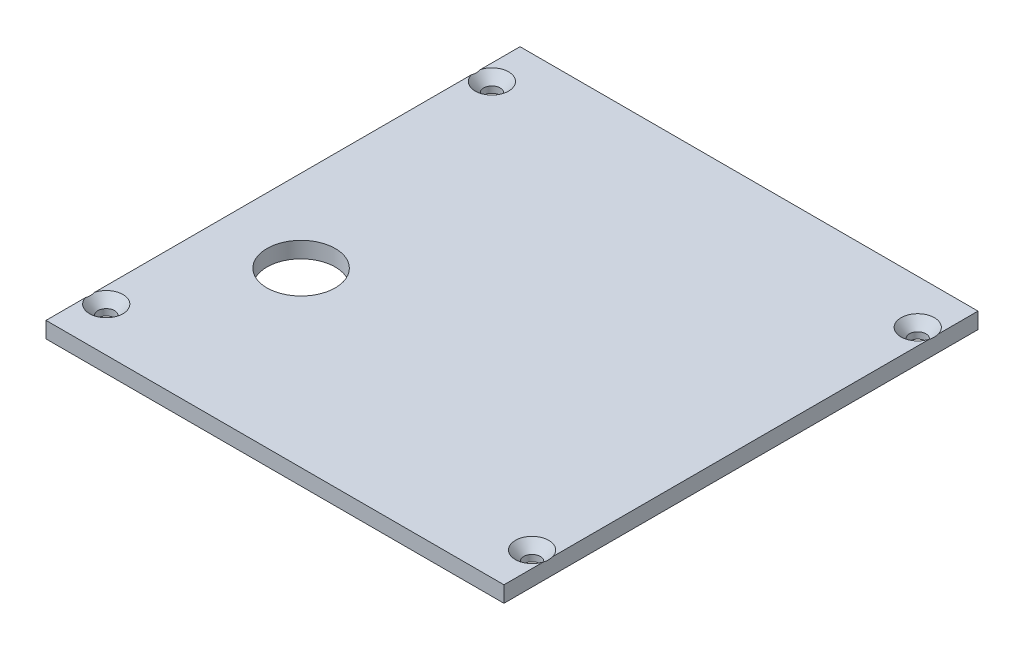
ISO-10303-21;
HEADER;
FILE_DESCRIPTION(('STEP AP214'),'2;1');
FILE_NAME('part.step','',(''),(''),'','','');
FILE_SCHEMA(('AUTOMOTIVE_DESIGN { 1 0 10303 214 1 1 1 1 }'));
ENDSEC;
DATA;
#1=APPLICATION_CONTEXT('core data for automotive mechanical design processes');
#2=APPLICATION_PROTOCOL_DEFINITION('international standard','automotive_design',2000,#1);
#3=PRODUCT_CONTEXT('',#1,'mechanical');
#4=PRODUCT('Part','Part','',(#3));
#5=PRODUCT_RELATED_PRODUCT_CATEGORY('part','',(#4));
#6=PRODUCT_DEFINITION_FORMATION('','',#4);
#7=PRODUCT_DEFINITION_CONTEXT('part definition',#1,'design');
#8=PRODUCT_DEFINITION('design','',#6,#7);
#9=PRODUCT_DEFINITION_SHAPE('','',#8);
#10=(LENGTH_UNIT() NAMED_UNIT(*) SI_UNIT(.MILLI.,.METRE.));
#11=(NAMED_UNIT(*) PLANE_ANGLE_UNIT() SI_UNIT($,.RADIAN.));
#12=(NAMED_UNIT(*) SI_UNIT($,.STERADIAN.) SOLID_ANGLE_UNIT());
#13=UNCERTAINTY_MEASURE_WITH_UNIT(LENGTH_MEASURE(1.E-05),#10,'distance_accuracy_value','');
#14=(GEOMETRIC_REPRESENTATION_CONTEXT(3) GLOBAL_UNCERTAINTY_ASSIGNED_CONTEXT((#13)) GLOBAL_UNIT_ASSIGNED_CONTEXT((#10,
#11,#12)) REPRESENTATION_CONTEXT('',''));
#15=CARTESIAN_POINT('',(0.,0.,0.));
#16=DIRECTION('',(0.,0.,1.));
#17=DIRECTION('',(1.,0.,0.));
#18=AXIS2_PLACEMENT_3D('',#15,#16,#17);
#19=CARTESIAN_POINT('',(0.,3.175,0.));
#20=DIRECTION('',(0.,-1.,0.));
#21=DIRECTION('',(0.,0.,-1.));
#22=AXIS2_PLACEMENT_3D('',#19,#20,#21);
#23=PLANE('',#22);
#24=CARTESIAN_POINT('',(-28.971875,3.175,12.7));
#25=DIRECTION('',(0.,1.,0.));
#26=DIRECTION('',(0.,0.,1.));
#27=AXIS2_PLACEMENT_3D('',#24,#25,#26);
#28=CIRCLE('',#27,6.746875);
#29=CARTESIAN_POINT('',(-28.971875,3.175,19.446875));
#30=VERTEX_POINT('',#29);
#31=EDGE_CURVE('E240',#30,#30,#28,.T.);
#32=ORIENTED_EDGE('',*,*,#31,.F.);
#33=EDGE_LOOP('',(#32));
#34=FACE_BOUND('',#33,.T.);
#35=CARTESIAN_POINT('',(42.06875,3.175,38.1));
#36=DIRECTION('',(0.,1.,0.));
#37=DIRECTION('',(0.,0.,1.));
#38=AXIS2_PLACEMENT_3D('',#35,#36,#37);
#39=CIRCLE('',#38,3.2990917);
#40=CARTESIAN_POINT('',(45.24375,3.175,37.2036847401672));
#41=VERTEX_POINT('',#40);
#42=CARTESIAN_POINT('',(45.24375,3.175,38.9963152598327));
#43=VERTEX_POINT('',#42);
#44=EDGE_CURVE('E52',#41,#43,#39,.T.);
#45=ORIENTED_EDGE('',*,*,#44,.F.);
#46=DIRECTION('',(0.,0.,-1.));
#47=VECTOR('',#46,1.);
#48=CARTESIAN_POINT('',(45.24375,3.175,-46.83125));
#49=LINE('',#48,#47);
#50=CARTESIAN_POINT('',(45.24375,3.175,-37.2036847401672));
#51=VERTEX_POINT('',#50);
#52=EDGE_CURVE('E106',#41,#51,#49,.T.);
#53=ORIENTED_EDGE('',*,*,#52,.T.);
#54=CARTESIAN_POINT('',(42.06875,3.175,-38.1));
#55=DIRECTION('',(0.,1.,0.));
#56=DIRECTION('',(0.,0.,1.));
#57=AXIS2_PLACEMENT_3D('',#54,#55,#56);
#58=CIRCLE('',#57,3.2990917);
#59=CARTESIAN_POINT('',(45.24375,3.175,-38.9963152598328));
#60=VERTEX_POINT('',#59);
#61=EDGE_CURVE('E207',#60,#51,#58,.T.);
#62=ORIENTED_EDGE('',*,*,#61,.F.);
#63=CARTESIAN_POINT('',(45.24375,3.175,-46.83125));
#64=VERTEX_POINT('',#63);
#65=EDGE_CURVE('E116',#60,#64,#49,.T.);
#66=ORIENTED_EDGE('',*,*,#65,.T.);
#67=DIRECTION('',(-1.,0.,0.));
#68=VECTOR('',#67,1.);
#69=CARTESIAN_POINT('',(45.24375,3.175,-46.83125));
#70=LINE('',#69,#68);
#71=CARTESIAN_POINT('',(-45.24375,3.175,-46.83125));
#72=VERTEX_POINT('',#71);
#73=EDGE_CURVE('E118',#64,#72,#70,.T.);
#74=ORIENTED_EDGE('',*,*,#73,.T.);
#75=DIRECTION('',(0.,0.,1.));
#76=VECTOR('',#75,1.);
#77=CARTESIAN_POINT('',(-45.24375,3.175,-46.83125));
#78=LINE('',#77,#76);
#79=CARTESIAN_POINT('',(-45.24375,3.175,-38.9963152598326));
#80=VERTEX_POINT('',#79);
#81=EDGE_CURVE('E198',#72,#80,#78,.T.);
#82=ORIENTED_EDGE('',*,*,#81,.T.);
#83=CARTESIAN_POINT('',(-42.06875,3.175,-38.1));
#84=DIRECTION('',(0.,1.,0.));
#85=DIRECTION('',(0.,0.,1.));
#86=AXIS2_PLACEMENT_3D('',#83,#84,#85);
#87=CIRCLE('',#86,3.2990917);
#88=CARTESIAN_POINT('',(-45.24375,3.175,-37.2036847401674));
#89=VERTEX_POINT('',#88);
#90=EDGE_CURVE('E58',#89,#80,#87,.T.);
#91=ORIENTED_EDGE('',*,*,#90,.F.);
#92=CARTESIAN_POINT('',(-45.24375,3.175,37.2036847401673));
#93=VERTEX_POINT('',#92);
#94=EDGE_CURVE('E205',#89,#93,#78,.T.);
#95=ORIENTED_EDGE('',*,*,#94,.T.);
#96=CARTESIAN_POINT('',(-42.06875,3.175,38.1));
#97=DIRECTION('',(0.,1.,0.));
#98=DIRECTION('',(0.,0.,1.));
#99=AXIS2_PLACEMENT_3D('',#96,#97,#98);
#100=CIRCLE('',#99,3.2990917);
#101=CARTESIAN_POINT('',(-45.24375,3.175,38.9963152598327));
#102=VERTEX_POINT('',#101);
#103=EDGE_CURVE('E225',#102,#93,#100,.T.);
#104=ORIENTED_EDGE('',*,*,#103,.F.);
#105=CARTESIAN_POINT('',(-45.24375,3.175,46.83125));
#106=VERTEX_POINT('',#105);
#107=EDGE_CURVE('E135',#102,#106,#78,.T.);
#108=ORIENTED_EDGE('',*,*,#107,.T.);
#109=DIRECTION('',(1.,0.,0.));
#110=VECTOR('',#109,1.);
#111=CARTESIAN_POINT('',(45.24375,3.175,46.83125));
#112=LINE('',#111,#110);
#113=CARTESIAN_POINT('',(45.24375,3.175,46.83125));
#114=VERTEX_POINT('',#113);
#115=EDGE_CURVE('E119',#106,#114,#112,.T.);
#116=ORIENTED_EDGE('',*,*,#115,.T.);
#117=EDGE_CURVE('E108',#114,#43,#49,.T.);
#118=ORIENTED_EDGE('',*,*,#117,.T.);
#119=EDGE_LOOP('',(#45,#53,#62,#66,#74,#82,#91,#95,#104,#108,#116,#118));
#120=FACE_BOUND('',#119,.T.);
#121=ADVANCED_FACE('F32',(#34,#120),#23,.F.);
#122=CARTESIAN_POINT('',(-45.24375,3.175,-46.83125));
#123=DIRECTION('',(1.,0.,0.));
#124=DIRECTION('',(0.,0.,-1.));
#125=AXIS2_PLACEMENT_3D('',#122,#123,#124);
#126=PLANE('',#125);
#127=ORIENTED_EDGE('',*,*,#94,.F.);
#128=CARTESIAN_POINT('',(-45.24375,6.989710070673,-43.9034326264607));
#129=CARTESIAN_POINT('',(-45.24375,6.87305813893157,-43.7878326298759));
#130=CARTESIAN_POINT('',(-45.24375,6.75679059182277,-43.6718418920867));
#131=CARTESIAN_POINT('',(-45.24375,6.5251952224115,-43.4389124786819));
#132=CARTESIAN_POINT('',(-45.24375,6.40986745755019,-43.3219737459819));
#133=CARTESIAN_POINT('',(-45.24375,6.18008387319701,-43.0867369402372));
#134=CARTESIAN_POINT('',(-45.24375,6.06563053557004,-42.9684364393237));
#135=CARTESIAN_POINT('',(-45.24375,5.83809959865298,-42.7305229725693));
#136=CARTESIAN_POINT('',(-45.24375,5.72502196963105,-42.6109100351995));
#137=CARTESIAN_POINT('',(-45.24375,5.49499972692886,-42.3641507826136));
#138=CARTESIAN_POINT('',(-45.24375,5.37814063659988,-42.2369245707484));
#139=CARTESIAN_POINT('',(-45.24375,5.14677123102929,-41.9803554876681));
#140=CARTESIAN_POINT('',(-45.24375,5.03226084221294,-41.8510126829857));
#141=CARTESIAN_POINT('',(-45.24375,4.80636213339492,-41.5898265297254));
#142=CARTESIAN_POINT('',(-45.24375,4.69497104962606,-41.4579855802024));
#143=CARTESIAN_POINT('',(-45.24375,4.47616547764946,-41.1910558796966));
#144=CARTESIAN_POINT('',(-45.24375,4.36875045307876,-41.0559675708617));
#145=CARTESIAN_POINT('',(-45.24375,4.16229712923296,-40.7856552414501));
#146=CARTESIAN_POINT('',(-45.24375,4.063106326339,-40.6505484495983));
#147=CARTESIAN_POINT('',(-45.24375,3.87156533114407,-40.3753782962137));
#148=CARTESIAN_POINT('',(-45.24375,3.77921978118362,-40.2353116644282));
#149=CARTESIAN_POINT('',(-45.24375,3.60532501089976,-39.9509146153839));
#150=CARTESIAN_POINT('',(-45.24375,3.52365752455923,-39.8066573297938));
#151=CARTESIAN_POINT('',(-45.24375,3.37393312067745,-39.5113162027645));
#152=CARTESIAN_POINT('',(-45.24375,3.30585320124994,-39.36024443823));
#153=CARTESIAN_POINT('',(-45.24375,3.22240302633766,-39.1396332332299));
#154=CARTESIAN_POINT('',(-45.24375,3.19919988534441,-39.0730389983241));
#155=CARTESIAN_POINT('',(-45.24375,3.15671831904853,-38.9384357966277));
#156=CARTESIAN_POINT('',(-45.24375,3.13744876910674,-38.8704240039713));
#157=CARTESIAN_POINT('',(-45.24375,3.1003077460929,-38.720833287961));
#158=CARTESIAN_POINT('',(-45.24375,3.08332335400403,-38.6390304687463));
#159=CARTESIAN_POINT('',(-45.24375,3.05633904271579,-38.474251309591));
#160=CARTESIAN_POINT('',(-45.24375,3.04634045929933,-38.3912747483078));
#161=CARTESIAN_POINT('',(-45.24375,3.03382521861158,-38.2248497036844));
#162=CARTESIAN_POINT('',(-45.24375,3.03129972265945,-38.1414018948921));
#163=CARTESIAN_POINT('',(-45.24375,3.03383658485633,-37.9746280645344));
#164=CARTESIAN_POINT('',(-45.24375,3.03889846478648,-37.8913020356247));
#165=CARTESIAN_POINT('',(-45.24375,3.05604892542834,-37.7282914966357));
#166=CARTESIAN_POINT('',(-45.24375,3.06788943816949,-37.6485804251183));
#167=CARTESIAN_POINT('',(-45.24375,3.09788708037763,-37.4903522736671));
#168=CARTESIAN_POINT('',(-45.24375,3.11604554095329,-37.4118354489868));
#169=CARTESIAN_POINT('',(-45.24375,3.15802658216042,-37.2562116975725));
#170=CARTESIAN_POINT('',(-45.24375,3.1818582027336,-37.1791072347425));
#171=CARTESIAN_POINT('',(-45.24375,3.2344233667454,-37.0266038839596));
#172=CARTESIAN_POINT('',(-45.24375,3.26315696966239,-36.951205016714));
#173=CARTESIAN_POINT('',(-45.24375,3.33338061296683,-36.7814142257047));
#174=CARTESIAN_POINT('',(-45.24375,3.37619587453448,-36.6875723520631));
#175=CARTESIAN_POINT('',(-45.24375,3.46733489242363,-36.5025964034572));
#176=CARTESIAN_POINT('',(-45.24375,3.51566050806365,-36.4114632556325));
#177=CARTESIAN_POINT('',(-45.24375,3.61681385113858,-36.2315315316244));
#178=CARTESIAN_POINT('',(-45.24375,3.66964951937834,-36.1427374489912));
#179=CARTESIAN_POINT('',(-45.24375,3.77887111919667,-35.9673954005948));
#180=CARTESIAN_POINT('',(-45.24375,3.83525642595159,-35.8808470432952));
#181=CARTESIAN_POINT('',(-45.24375,3.951789697403,-35.7084037838518));
#182=CARTESIAN_POINT('',(-45.24375,4.01198187504771,-35.6225388871093));
#183=CARTESIAN_POINT('',(-45.24375,4.13478793957747,-35.4525616558967));
#184=CARTESIAN_POINT('',(-45.24375,4.1974018937254,-35.368449370204));
#185=CARTESIAN_POINT('',(-45.24375,4.32455372262778,-35.2018352843151));
#186=CARTESIAN_POINT('',(-45.24375,4.38908951289633,-35.1193318890963));
#187=CARTESIAN_POINT('',(-45.24375,4.51981187211302,-34.9556527007914));
#188=CARTESIAN_POINT('',(-45.24375,4.58599837348585,-34.8744768535837));
#189=CARTESIAN_POINT('',(-45.24375,4.80862518728445,-34.6061434736446));
#190=CARTESIAN_POINT('',(-45.24375,4.9681115981241,-34.4215122675117));
#191=CARTESIAN_POINT('',(-45.24375,5.2921977748846,-34.0567795972118));
#192=CARTESIAN_POINT('',(-45.24375,5.45679845873086,-33.8766789568249));
#193=CARTESIAN_POINT('',(-45.24375,5.78975187696567,-33.5198110738286));
#194=CARTESIAN_POINT('',(-45.24375,5.95810654527786,-33.3430456402109));
#195=CARTESIAN_POINT('',(-45.24375,6.29753521271734,-32.9921433817898));
#196=CARTESIAN_POINT('',(-45.24375,6.468609295641,-32.8180066383108));
#197=CARTESIAN_POINT('',(-45.24375,6.81325931704773,-32.4713568700036));
#198=CARTESIAN_POINT('',(-45.24375,6.98684047303314,-32.2988490415872));
#199=CARTESIAN_POINT('',(-45.24375,7.33562797786353,-31.9554816145835));
#200=CARTESIAN_POINT('',(-45.24375,7.5108343516648,-31.7846220413886));
#201=CARTESIAN_POINT('',(-45.24375,8.0382509971399,-31.2741375068304));
#202=CARTESIAN_POINT('',(-45.24375,8.39237512276739,-30.9364907041535));
#203=CARTESIAN_POINT('',(-45.24375,9.06030852273246,-30.3059938274068));
#204=CARTESIAN_POINT('',(-45.24375,9.37373097008681,-30.0127322139278));
#205=CARTESIAN_POINT('',(-45.24375,10.0025060482199,-29.428225646975));
#206=CARTESIAN_POINT('',(-45.24375,10.3178588611297,-29.1369808894949));
#207=CARTESIAN_POINT('',(-45.24375,10.9485176914573,-28.5573828121677));
#208=CARTESIAN_POINT('',(-45.24375,11.2638171513183,-28.2690223474066));
#209=CARTESIAN_POINT('',(-45.24375,11.8954830947937,-27.6935445814536));
#210=CARTESIAN_POINT('',(-45.24375,12.2118494525817,-27.4064271421975));
#211=CARTESIAN_POINT('',(-45.24375,12.5286162920423,-27.1197545351163));
#212=B_SPLINE_CURVE_WITH_KNOTS('',3,(#128,#129,#130,#131,#132,#133,#134,#135,#136,#137,#138,
#139,#140,#141,#142,#143,#144,#145,#146,#147,#148,#149,#150,#151,#152,#153,#154,#155,#156,#157,
#158,#159,#160,#161,#162,#163,#164,#165,#166,#167,#168,#169,#170,#171,#172,#173,#174,#175,#176,
#177,#178,#179,#180,#181,#182,#183,#184,#185,#186,#187,#188,#189,#190,#191,#192,#193,#194,#195,
#196,#197,#198,#199,#200,#201,#202,#203,#204,#205,#206,#207,#208,#209,#210,#211),.UNSPECIFIED.,
.F.,.F.,(4,2,2,2,2,2,2,2,2,2,2,2,2,2,2,2,2,2,2,2,2,2,2,2,2,2,2,2,2,2,2,2,2,2,2,2,2,2,2,2,2,4),
(0.,0.492687873977187,0.985405639374898,1.47920931164693,1.9730022927932,2.49122930634338,
3.00944006119379,3.52717612915784,4.04484209905923,4.54751630419466,5.05052835376831,
5.54738625055593,6.04339576449105,6.25485653533402,6.46678927619565,6.71715112238516,
6.96756082811849,7.21767424695734,7.46777190225355,7.70925400946692,7.95078702462907,
8.1927075195642,8.43463095005899,8.74384066836764,9.05315503153315,9.3630257016498,
9.6728419786031,9.98737469808601,10.3019161597442,10.6161280664448,10.9303271312707,
11.662096401547,12.3939977794678,13.1262853413443,13.8585955119294,14.5927507536451,
15.3269172875283,16.7947575115168,18.0824301844585,19.3702262824726,20.652053598462,
21.9337346871531),.UNSPECIFIED.);
#213=EDGE_CURVE('E46',#89,#80,#212,.F.);
#214=ORIENTED_EDGE('',*,*,#213,.T.);
#215=ORIENTED_EDGE('',*,*,#81,.F.);
#216=DIRECTION('',(0.,-1.,0.));
#217=VECTOR('',#216,1.);
#218=CARTESIAN_POINT('',(-45.24375,3.175,-46.83125));
#219=LINE('',#218,#217);
#220=CARTESIAN_POINT('',(-45.24375,0.,-46.83125));
#221=VERTEX_POINT('',#220);
#222=EDGE_CURVE('E124',#72,#221,#219,.T.);
#223=ORIENTED_EDGE('',*,*,#222,.T.);
#224=DIRECTION('',(0.,0.,1.));
#225=VECTOR('',#224,1.);
#226=CARTESIAN_POINT('',(-45.24375,0.,-46.83125));
#227=LINE('',#226,#225);
#228=CARTESIAN_POINT('',(-45.24375,0.,46.83125));
#229=VERTEX_POINT('',#228);
#230=EDGE_CURVE('E125',#221,#229,#227,.T.);
#231=ORIENTED_EDGE('',*,*,#230,.T.);
#232=DIRECTION('',(0.,-1.,0.));
#233=VECTOR('',#232,1.);
#234=CARTESIAN_POINT('',(-45.24375,3.175,46.83125));
#235=LINE('',#234,#233);
#236=EDGE_CURVE('E144',#106,#229,#235,.T.);
#237=ORIENTED_EDGE('',*,*,#236,.F.);
#238=ORIENTED_EDGE('',*,*,#107,.F.);
#239=CARTESIAN_POINT('',(-45.24375,6.98971006939015,32.2965673748104));
#240=CARTESIAN_POINT('',(-45.24375,6.87305813769032,32.4121673713599));
#241=CARTESIAN_POINT('',(-45.24375,6.75679059062309,32.5281581091137));
#242=CARTESIAN_POINT('',(-45.24375,6.5251952212949,32.7610875224474));
#243=CARTESIAN_POINT('',(-45.24375,6.40986745647509,32.8780262551119));
#244=CARTESIAN_POINT('',(-45.24375,6.18008387220493,33.1132630607852));
#245=CARTESIAN_POINT('',(-45.24375,6.06563053461948,33.2315635616629));
#246=CARTESIAN_POINT('',(-45.24375,5.8380995977853,33.4694770283453));
#247=CARTESIAN_POINT('',(-45.24375,5.7250219688047,33.589089965679));
#248=CARTESIAN_POINT('',(-45.24375,5.49499972618867,33.8358492181888));
#249=CARTESIAN_POINT('',(-45.24375,5.37814063590446,33.9630754300139));
#250=CARTESIAN_POINT('',(-45.24375,5.14677123042286,34.2196445130133));
#251=CARTESIAN_POINT('',(-45.24375,5.03226084165072,34.3489873176549));
#252=CARTESIAN_POINT('',(-45.24375,4.80636213292021,34.6101734708329));
#253=CARTESIAN_POINT('',(-45.24375,4.69497104919465,34.7420144203142));
#254=CARTESIAN_POINT('',(-45.24375,4.47616547730326,35.0089441207354));
#255=CARTESIAN_POINT('',(-45.24375,4.36875045277447,35.1440324295273));
#256=CARTESIAN_POINT('',(-45.24375,4.16229712899054,35.4143447588764));
#257=CARTESIAN_POINT('',(-45.24375,4.06310632611753,35.5494515507094));
#258=CARTESIAN_POINT('',(-45.24375,3.87156533096386,35.8246217040556));
#259=CARTESIAN_POINT('',(-45.24375,3.77921978102372,35.9646883358215));
#260=CARTESIAN_POINT('',(-45.24375,3.60532501077874,36.2490853848257));
#261=CARTESIAN_POINT('',(-45.24375,3.52365752445681,36.3933426703954));
#262=CARTESIAN_POINT('',(-45.24375,3.37393312060966,36.688683797382));
#263=CARTESIAN_POINT('',(-45.24375,3.30585320119819,36.8397555618942));
#264=CARTESIAN_POINT('',(-45.24375,3.22240302630457,37.0603667668629));
#265=CARTESIAN_POINT('',(-45.24375,3.19919988531602,37.1269610017606));
#266=CARTESIAN_POINT('',(-45.24375,3.1567183190287,37.2615642034404));
#267=CARTESIAN_POINT('',(-45.24375,3.13744876909077,37.3295759960883));
#268=CARTESIAN_POINT('',(-45.24375,3.10030774608519,37.4791667120755));
#269=CARTESIAN_POINT('',(-45.24375,3.0833233540002,37.5609695312757));
#270=CARTESIAN_POINT('',(-45.24375,3.05633904271722,37.7257486904015));
#271=CARTESIAN_POINT('',(-45.24375,3.04634045930214,37.8087252516697));
#272=CARTESIAN_POINT('',(-45.24375,3.0338252186144,37.975150296263));
#273=CARTESIAN_POINT('',(-45.24375,3.03129972266091,38.0585981050401));
#274=CARTESIAN_POINT('',(-45.24375,3.03383658485234,38.225371935368));
#275=CARTESIAN_POINT('',(-45.24375,3.0388984647784,38.3086979642629));
#276=CARTESIAN_POINT('',(-45.24375,3.05604892541255,38.4717085032489));
#277=CARTESIAN_POINT('',(-45.24375,3.06788943815234,38.5514195747779));
#278=CARTESIAN_POINT('',(-45.24375,3.09788708035977,38.7096477262522));
#279=CARTESIAN_POINT('',(-45.24375,3.11604554093608,38.7881645509439));
#280=CARTESIAN_POINT('',(-45.24375,3.15802658214632,38.9437883023809));
#281=CARTESIAN_POINT('',(-45.24375,3.18185820272197,39.020892765222));
#282=CARTESIAN_POINT('',(-45.24375,3.23442336674016,39.173396116027));
#283=CARTESIAN_POINT('',(-45.24375,3.26315696966108,39.2487949832833));
#284=CARTESIAN_POINT('',(-45.24375,3.33338061297039,39.4185857743034));
#285=CARTESIAN_POINT('',(-45.24375,3.37619587453841,39.5124276479453));
#286=CARTESIAN_POINT('',(-45.24375,3.46733489242831,39.6974035965519));
#287=CARTESIAN_POINT('',(-45.24375,3.51566050806871,39.7885367443769));
#288=CARTESIAN_POINT('',(-45.24375,3.61681385114441,39.9684684683856));
#289=CARTESIAN_POINT('',(-45.24375,3.66964951938455,40.0572625510191));
#290=CARTESIAN_POINT('',(-45.24375,3.77887111920365,40.2326045994161));
#291=CARTESIAN_POINT('',(-45.24375,3.83525642595895,40.319152956716));
#292=CARTESIAN_POINT('',(-45.24375,3.95178969741107,40.4915962161599));
#293=CARTESIAN_POINT('',(-45.24375,4.01198187505612,40.5774611129026));
#294=CARTESIAN_POINT('',(-45.24375,4.13478793958654,40.7474383441156));
#295=CARTESIAN_POINT('',(-45.24375,4.1974018937348,40.8315506298086));
#296=CARTESIAN_POINT('',(-45.24375,4.32455372263783,40.9981647156978));
#297=CARTESIAN_POINT('',(-45.24375,4.38908951290671,41.0806681109169));
#298=CARTESIAN_POINT('',(-45.24375,4.51981187212403,41.2443472992223));
#299=CARTESIAN_POINT('',(-45.24375,4.58599837349718,41.3255231464301));
#300=CARTESIAN_POINT('',(-45.24375,4.80862518729734,41.5938565263706));
#301=CARTESIAN_POINT('',(-45.24375,4.96811159813823,41.7784877325046));
#302=CARTESIAN_POINT('',(-45.24375,5.29219777490124,42.1432204028066));
#303=CARTESIAN_POINT('',(-45.24375,5.45679845874875,42.3233210431946));
#304=CARTESIAN_POINT('',(-45.24375,5.78975187698608,42.680188926193));
#305=CARTESIAN_POINT('',(-45.24375,5.95810654529953,42.8569543598117));
#306=CARTESIAN_POINT('',(-45.24375,6.29753521274153,43.2078566182349));
#307=CARTESIAN_POINT('',(-45.24375,6.46860929566645,43.381993361715));
#308=CARTESIAN_POINT('',(-45.24375,6.8132593170757,43.7286431300243));
#309=CARTESIAN_POINT('',(-45.24375,6.98684047306238,43.9011509584418));
#310=CARTESIAN_POINT('',(-45.24375,7.33562797789528,44.2445183854476));
#311=CARTESIAN_POINT('',(-45.24375,7.51083435169782,44.4153779586435));
#312=CARTESIAN_POINT('',(-45.24375,8.03825099717669,44.9258624932049));
#313=CARTESIAN_POINT('',(-45.24375,8.3923751228067,45.2635092958839));
#314=CARTESIAN_POINT('',(-45.24375,9.06030852277672,45.8940061726348));
#315=CARTESIAN_POINT('',(-45.24375,9.37373097013352,46.1872677861158));
#316=CARTESIAN_POINT('',(-45.24375,10.0025060482715,46.7717743530728));
#317=CARTESIAN_POINT('',(-45.24375,10.3178588611837,47.063019110555));
#318=CARTESIAN_POINT('',(-45.24375,10.9485176915162,47.6426171878863));
#319=CARTESIAN_POINT('',(-45.24375,11.2638171513797,47.9309776526494));
#320=CARTESIAN_POINT('',(-45.24375,11.8954830948599,48.5064554186066));
#321=CARTESIAN_POINT('',(-45.24375,12.2118494526504,48.7935728578647));
#322=CARTESIAN_POINT('',(-45.24375,12.5286162921134,49.0802454649481));
#323=B_SPLINE_CURVE_WITH_KNOTS('',3,(#239,#240,#241,#242,#243,#244,#245,#246,#247,#248,#249,
#250,#251,#252,#253,#254,#255,#256,#257,#258,#259,#260,#261,#262,#263,#264,#265,#266,#267,#268,
#269,#270,#271,#272,#273,#274,#275,#276,#277,#278,#279,#280,#281,#282,#283,#284,#285,#286,#287,
#288,#289,#290,#291,#292,#293,#294,#295,#296,#297,#298,#299,#300,#301,#302,#303,#304,#305,#306,
#307,#308,#309,#310,#311,#312,#313,#314,#315,#316,#317,#318,#319,#320,#321,#322),.UNSPECIFIED.,
.F.,.F.,(4,2,2,2,2,2,2,2,2,2,2,2,2,2,2,2,2,2,2,2,2,2,2,2,2,2,2,2,2,2,2,2,2,2,2,2,2,2,2,2,2,4),
(0.,0.492687873813839,0.985405639048182,1.47920931115632,1.97300229213869,2.49122930550939,
3.00944006018034,3.52717612796519,4.04484209768744,4.5475163027403,5.05052835223123,
5.54738624893816,6.04339576279292,6.2548565336083,6.4667892744422,6.71715112058674,
6.96756082627509,7.21767424506898,7.46777190032028,7.70925400756735,7.95078702276325,
8.19270751773262,8.43463094826164,8.74384066657169,9.05315502973856,9.36302569985656,
9.67284197681122,9.98737469629523,10.3019161579546,10.6161280646562,10.9303271294832,
11.6620963997645,12.3939977776902,13.1262853395716,13.8585955101616,14.5927507518822,
15.3269172857703,16.7947575097686,18.0824301827198,19.3702262807436,20.6520535967425,
21.9337346854433),.UNSPECIFIED.);
#324=EDGE_CURVE('E152',#102,#93,#323,.F.);
#325=ORIENTED_EDGE('',*,*,#324,.T.);
#326=EDGE_LOOP('',(#127,#214,#215,#223,#231,#237,#238,#325));
#327=FACE_BOUND('',#326,.T.);
#328=ADVANCED_FACE('F34',(#327),#126,.F.);
#329=CARTESIAN_POINT('',(45.24375,3.175,46.83125));
#330=DIRECTION('',(0.,0.,-1.));
#331=DIRECTION('',(-1.,0.,0.));
#332=AXIS2_PLACEMENT_3D('',#329,#330,#331);
#333=PLANE('',#332);
#334=DIRECTION('',(1.,0.,0.));
#335=VECTOR('',#334,1.);
#336=CARTESIAN_POINT('',(45.24375,0.,46.83125));
#337=LINE('',#336,#335);
#338=CARTESIAN_POINT('',(45.24375,0.,46.83125));
#339=VERTEX_POINT('',#338);
#340=EDGE_CURVE('E128',#229,#339,#337,.T.);
#341=ORIENTED_EDGE('',*,*,#340,.T.);
#342=DIRECTION('',(0.,-1.,0.));
#343=VECTOR('',#342,1.);
#344=CARTESIAN_POINT('',(45.24375,3.175,46.83125));
#345=LINE('',#344,#343);
#346=EDGE_CURVE('E141',#114,#339,#345,.T.);
#347=ORIENTED_EDGE('',*,*,#346,.F.);
#348=ORIENTED_EDGE('',*,*,#115,.F.);
#349=ORIENTED_EDGE('',*,*,#236,.T.);
#350=EDGE_LOOP('',(#341,#347,#348,#349));
#351=FACE_BOUND('',#350,.T.);
#352=ADVANCED_FACE('F185',(#351),#333,.F.);
#353=CARTESIAN_POINT('',(45.24375,3.175,-46.83125));
#354=DIRECTION('',(-1.,0.,0.));
#355=DIRECTION('',(0.,0.,1.));
#356=AXIS2_PLACEMENT_3D('',#353,#354,#355);
#357=PLANE('',#356);
#358=ORIENTED_EDGE('',*,*,#52,.F.);
#359=CARTESIAN_POINT('',(45.24375,6.98971007067305,32.2965673735392));
#360=CARTESIAN_POINT('',(45.24375,6.87305813893163,32.412167370124));
#361=CARTESIAN_POINT('',(45.24375,6.75679059182283,32.5281581079133));
#362=CARTESIAN_POINT('',(45.24375,6.52519522241155,32.761087521318));
#363=CARTESIAN_POINT('',(45.24375,6.40986745755023,32.878026254018));
#364=CARTESIAN_POINT('',(45.24375,6.18008387319704,33.1132630597627));
#365=CARTESIAN_POINT('',(45.24375,6.06563053557007,33.2315635606762));
#366=CARTESIAN_POINT('',(45.24375,5.83809959865302,33.4694770274306));
#367=CARTESIAN_POINT('',(45.24375,5.72502196963108,33.5890899648004));
#368=CARTESIAN_POINT('',(45.24375,5.49499972692888,33.8358492173864));
#369=CARTESIAN_POINT('',(45.24375,5.37814063659991,33.9630754292516));
#370=CARTESIAN_POINT('',(45.24375,5.14677123102931,34.2196445123319));
#371=CARTESIAN_POINT('',(45.24375,5.03226084221295,34.3489873170143));
#372=CARTESIAN_POINT('',(45.24375,4.80636213339492,34.6101734702746));
#373=CARTESIAN_POINT('',(45.24375,4.69497104962606,34.7420144197976));
#374=CARTESIAN_POINT('',(45.24375,4.47616547764946,35.0089441203033));
#375=CARTESIAN_POINT('',(45.24375,4.36875045307876,35.1440324291382));
#376=CARTESIAN_POINT('',(45.24375,4.16229712923295,35.4143447585498));
#377=CARTESIAN_POINT('',(45.24375,4.06310632633899,35.5494515504016));
#378=CARTESIAN_POINT('',(45.24375,3.87156533114406,35.8246217037862));
#379=CARTESIAN_POINT('',(45.24375,3.7792197811836,35.9646883355718));
#380=CARTESIAN_POINT('',(45.24375,3.60532501089973,36.2490853846161));
#381=CARTESIAN_POINT('',(45.24375,3.52365752455921,36.3933426702062));
#382=CARTESIAN_POINT('',(45.24375,3.37393312067742,36.6886837972355));
#383=CARTESIAN_POINT('',(45.24375,3.30585320124991,36.83975556177));
#384=CARTESIAN_POINT('',(45.24375,3.22240302633763,37.0603667667701));
#385=CARTESIAN_POINT('',(45.24375,3.19919988534438,37.1269610016759));
#386=CARTESIAN_POINT('',(45.24375,3.15671831904849,37.2615642033723));
#387=CARTESIAN_POINT('',(45.24375,3.1374487691067,37.3295759960287));
#388=CARTESIAN_POINT('',(45.24375,3.10030774609286,37.4791667120389));
#389=CARTESIAN_POINT('',(45.24375,3.08332335400399,37.5609695312537));
#390=CARTESIAN_POINT('',(45.24375,3.05633904271575,37.725748690409));
#391=CARTESIAN_POINT('',(45.24375,3.04634045929929,37.8087252516922));
#392=CARTESIAN_POINT('',(45.24375,3.03382521861154,37.9751502963156));
#393=CARTESIAN_POINT('',(45.24375,3.03129972265941,38.0585981051078));
#394=CARTESIAN_POINT('',(45.24375,3.03383658485629,38.2253719354656));
#395=CARTESIAN_POINT('',(45.24375,3.03889846478644,38.3086979643753));
#396=CARTESIAN_POINT('',(45.24375,3.0560489254283,38.4717085033642));
#397=CARTESIAN_POINT('',(45.24375,3.06788943816945,38.5514195748817));
#398=CARTESIAN_POINT('',(45.24375,3.09788708037759,38.7096477263329));
#399=CARTESIAN_POINT('',(45.24375,3.11604554095325,38.7881645510132));
#400=CARTESIAN_POINT('',(45.24375,3.15802658216037,38.9437883024275));
#401=CARTESIAN_POINT('',(45.24375,3.18185820273356,39.0208927652575));
#402=CARTESIAN_POINT('',(45.24375,3.23442336674536,39.1733961160404));
#403=CARTESIAN_POINT('',(45.24375,3.26315696966235,39.248794983286));
#404=CARTESIAN_POINT('',(45.24375,3.33338061296678,39.4185857742953));
#405=CARTESIAN_POINT('',(45.24375,3.37619587453443,39.5124276479369));
#406=CARTESIAN_POINT('',(45.24375,3.46733489242357,39.6974035965428));
#407=CARTESIAN_POINT('',(45.24375,3.51566050806359,39.7885367443675));
#408=CARTESIAN_POINT('',(45.24375,3.61681385113852,39.9684684683756));
#409=CARTESIAN_POINT('',(45.24375,3.66964951937828,40.0572625510087));
#410=CARTESIAN_POINT('',(45.24375,3.77887111919661,40.2326045994052));
#411=CARTESIAN_POINT('',(45.24375,3.83525642595152,40.3191529567047));
#412=CARTESIAN_POINT('',(45.24375,3.95178969740293,40.4915962161482));
#413=CARTESIAN_POINT('',(45.24375,4.01198187504764,40.5774611128907));
#414=CARTESIAN_POINT('',(45.24375,4.1347879395774,40.7474383441032));
#415=CARTESIAN_POINT('',(45.24375,4.19740189372533,40.831550629796));
#416=CARTESIAN_POINT('',(45.24375,4.3245537226277,40.9981647156848));
#417=CARTESIAN_POINT('',(45.24375,4.38908951289625,41.0806681109036));
#418=CARTESIAN_POINT('',(45.24375,4.51981187211293,41.2443472992086));
#419=CARTESIAN_POINT('',(45.24375,4.58599837348576,41.3255231464162));
#420=CARTESIAN_POINT('',(45.24375,4.80862518728437,41.5938565263554));
#421=CARTESIAN_POINT('',(45.24375,4.96811159812401,41.7784877324882));
#422=CARTESIAN_POINT('',(45.24375,5.2921977748845,42.1432204027881));
#423=CARTESIAN_POINT('',(45.24375,5.45679845873075,42.3233210431751));
#424=CARTESIAN_POINT('',(45.24375,5.78975187696555,42.6801889261713));
#425=CARTESIAN_POINT('',(45.24375,5.95810654527774,42.856954359789));
#426=CARTESIAN_POINT('',(45.24375,6.2975352127172,43.20785661821));
#427=CARTESIAN_POINT('',(45.24375,6.46860929564086,43.381993361689));
#428=CARTESIAN_POINT('',(45.24375,6.81325931704757,43.7286431299963));
#429=CARTESIAN_POINT('',(45.24375,6.98684047303298,43.9011509584127));
#430=CARTESIAN_POINT('',(45.24375,7.33562797786336,44.2445183854164));
#431=CARTESIAN_POINT('',(45.24375,7.51083435166463,44.4153779586112));
#432=CARTESIAN_POINT('',(45.24375,8.03825099713971,44.9258624931694));
#433=CARTESIAN_POINT('',(45.24375,8.39237512276719,45.2635092958464));
#434=CARTESIAN_POINT('',(45.24375,9.06030852273224,45.8940061725931));
#435=CARTESIAN_POINT('',(45.24375,9.37373097008659,46.187267786072));
#436=CARTESIAN_POINT('',(45.24375,10.0025060482197,46.7717743530248));
#437=CARTESIAN_POINT('',(45.24375,10.3178588611294,47.0630191105049));
#438=CARTESIAN_POINT('',(45.24375,10.948517691457,47.6426171878321));
#439=CARTESIAN_POINT('',(45.24375,11.263817151318,47.9309776525931));
#440=CARTESIAN_POINT('',(45.24375,11.8954830947934,48.5064554185462));
#441=CARTESIAN_POINT('',(45.24375,12.2118494525814,48.7935728578022));
#442=CARTESIAN_POINT('',(45.24375,12.528616292042,49.0802454648835));
#443=B_SPLINE_CURVE_WITH_KNOTS('',3,(#359,#360,#361,#362,#363,#364,#365,#366,#367,#368,#369,
#370,#371,#372,#373,#374,#375,#376,#377,#378,#379,#380,#381,#382,#383,#384,#385,#386,#387,#388,
#389,#390,#391,#392,#393,#394,#395,#396,#397,#398,#399,#400,#401,#402,#403,#404,#405,#406,#407,
#408,#409,#410,#411,#412,#413,#414,#415,#416,#417,#418,#419,#420,#421,#422,#423,#424,#425,#426,
#427,#428,#429,#430,#431,#432,#433,#434,#435,#436,#437,#438,#439,#440,#441,#442),.UNSPECIFIED.,
.F.,.F.,(4,2,2,2,2,2,2,2,2,2,2,2,2,2,2,2,2,2,2,2,2,2,2,2,2,2,2,2,2,2,2,2,2,2,2,2,2,2,2,2,2,4),
(0.,0.492687873977198,0.985405639374921,1.47920931164696,1.97300229279324,2.49122930634342,
3.00944006119386,3.52717612915791,4.04484209905931,4.54751630419474,5.0505283537684,
5.54738625055604,6.04339576449116,6.25485653533412,6.46678927619575,6.71715112238526,
6.96756082811859,7.21767424695744,7.46777190225365,7.70925400946703,7.95078702462917,
8.19270751956429,8.43463095005908,8.74384066836773,9.05315503153322,9.36302570164986,
9.67284197860316,9.98737469808607,10.3019161597443,10.6161280664448,10.9303271312707,
11.662096401547,12.3939977794678,13.1262853413443,13.8585955119294,14.5927507536451,
15.3269172875282,16.7947575115167,18.0824301844583,19.3702262824724,20.6520535984617,
21.9337346871528),.UNSPECIFIED.);
#444=EDGE_CURVE('E11',#41,#43,#443,.T.);
#445=ORIENTED_EDGE('',*,*,#444,.T.);
#446=ORIENTED_EDGE('',*,*,#117,.F.);
#447=ORIENTED_EDGE('',*,*,#346,.T.);
#448=DIRECTION('',(0.,0.,-1.));
#449=VECTOR('',#448,1.);
#450=CARTESIAN_POINT('',(45.24375,0.,-46.83125));
#451=LINE('',#450,#449);
#452=CARTESIAN_POINT('',(45.24375,0.,-46.83125));
#453=VERTEX_POINT('',#452);
#454=EDGE_CURVE('E131',#339,#453,#451,.T.);
#455=ORIENTED_EDGE('',*,*,#454,.T.);
#456=DIRECTION('',(0.,-1.,0.));
#457=VECTOR('',#456,1.);
#458=CARTESIAN_POINT('',(45.24375,3.175,-46.83125));
#459=LINE('',#458,#457);
#460=EDGE_CURVE('E138',#64,#453,#459,.T.);
#461=ORIENTED_EDGE('',*,*,#460,.F.);
#462=ORIENTED_EDGE('',*,*,#65,.F.);
#463=CARTESIAN_POINT('',(45.24375,6.98971006939015,-43.9034326251896));
#464=CARTESIAN_POINT('',(45.24375,6.87305813769032,-43.7878326286402));
#465=CARTESIAN_POINT('',(45.24375,6.75679059062309,-43.6718418908864));
#466=CARTESIAN_POINT('',(45.24375,6.5251952212949,-43.4389124775526));
#467=CARTESIAN_POINT('',(45.24375,6.40986745647509,-43.3219737448881));
#468=CARTESIAN_POINT('',(45.24375,6.18008387220493,-43.0867369392148));
#469=CARTESIAN_POINT('',(45.24375,6.06563053461948,-42.9684364383372));
#470=CARTESIAN_POINT('',(45.24375,5.83809959778529,-42.7305229716547));
#471=CARTESIAN_POINT('',(45.24375,5.7250219688047,-42.610910034321));
#472=CARTESIAN_POINT('',(45.24375,5.49499972618866,-42.3641507818112));
#473=CARTESIAN_POINT('',(45.24375,5.37814063590445,-42.2369245699861));
#474=CARTESIAN_POINT('',(45.24375,5.14677123042285,-41.9803554869867));
#475=CARTESIAN_POINT('',(45.24375,5.03226084165071,-41.8510126823451));
#476=CARTESIAN_POINT('',(45.24375,4.80636213292019,-41.5898265291671));
#477=CARTESIAN_POINT('',(45.24375,4.69497104919463,-41.4579855796858));
#478=CARTESIAN_POINT('',(45.24375,4.47616547730323,-41.1910558792646));
#479=CARTESIAN_POINT('',(45.24375,4.36875045277444,-41.0559675704727));
#480=CARTESIAN_POINT('',(45.24375,4.16229712899051,-40.7856552411236));
#481=CARTESIAN_POINT('',(45.24375,4.0631063261175,-40.6505484492906));
#482=CARTESIAN_POINT('',(45.24375,3.87156533096382,-40.3753782959444));
#483=CARTESIAN_POINT('',(45.24375,3.77921978102369,-40.2353116641785));
#484=CARTESIAN_POINT('',(45.24375,3.6053250107787,-39.9509146151743));
#485=CARTESIAN_POINT('',(45.24375,3.52365752445678,-39.8066573296047));
#486=CARTESIAN_POINT('',(45.24375,3.37393312060963,-39.511316202618));
#487=CARTESIAN_POINT('',(45.24375,3.30585320119816,-39.3602444381058));
#488=CARTESIAN_POINT('',(45.24375,3.22240302630455,-39.1396332331371));
#489=CARTESIAN_POINT('',(45.24375,3.19919988531599,-39.0730389982394));
#490=CARTESIAN_POINT('',(45.24375,3.15671831902867,-38.9384357965597));
#491=CARTESIAN_POINT('',(45.24375,3.13744876909075,-38.8704240039118));
#492=CARTESIAN_POINT('',(45.24375,3.10030774608516,-38.7208332879245));
#493=CARTESIAN_POINT('',(45.24375,3.08332335400017,-38.6390304687243));
#494=CARTESIAN_POINT('',(45.24375,3.05633904271719,-38.4742513095986));
#495=CARTESIAN_POINT('',(45.24375,3.0463404593021,-38.3912747483303));
#496=CARTESIAN_POINT('',(45.24375,3.03382521861437,-38.224849703737));
#497=CARTESIAN_POINT('',(45.24375,3.03129972266088,-38.1414018949599));
#498=CARTESIAN_POINT('',(45.24375,3.03383658485231,-37.974628064632));
#499=CARTESIAN_POINT('',(45.24375,3.03889846477837,-37.8913020357371));
#500=CARTESIAN_POINT('',(45.24375,3.05604892541252,-37.7282914967512));
#501=CARTESIAN_POINT('',(45.24375,3.06788943815231,-37.6485804252221));
#502=CARTESIAN_POINT('',(45.24375,3.09788708035974,-37.4903522737478));
#503=CARTESIAN_POINT('',(45.24375,3.11604554093605,-37.4118354490561));
#504=CARTESIAN_POINT('',(45.24375,3.15802658214628,-37.2562116976191));
#505=CARTESIAN_POINT('',(45.24375,3.18185820272193,-37.179107234778));
#506=CARTESIAN_POINT('',(45.24375,3.23442336674012,-37.0266038839731));
#507=CARTESIAN_POINT('',(45.24375,3.26315696966104,-36.9512050167167));
#508=CARTESIAN_POINT('',(45.24375,3.33338061297035,-36.7814142256966));
#509=CARTESIAN_POINT('',(45.24375,3.37619587453837,-36.6875723520547));
#510=CARTESIAN_POINT('',(45.24375,3.46733489242826,-36.5025964034481));
#511=CARTESIAN_POINT('',(45.24375,3.51566050806866,-36.4114632556231));
#512=CARTESIAN_POINT('',(45.24375,3.61681385114436,-36.2315315316144));
#513=CARTESIAN_POINT('',(45.24375,3.6696495193845,-36.142737448981));
#514=CARTESIAN_POINT('',(45.24375,3.77887111920359,-35.9673954005839));
#515=CARTESIAN_POINT('',(45.24375,3.83525642595889,-35.8808470432841));
#516=CARTESIAN_POINT('',(45.24375,3.95178969741101,-35.7084037838402));
#517=CARTESIAN_POINT('',(45.24375,4.01198187505606,-35.6225388870974));
#518=CARTESIAN_POINT('',(45.24375,4.13478793958647,-35.4525616558845));
#519=CARTESIAN_POINT('',(45.24375,4.19740189373473,-35.3684493701915));
#520=CARTESIAN_POINT('',(45.24375,4.32455372263775,-35.2018352843022));
#521=CARTESIAN_POINT('',(45.24375,4.38908951290663,-35.1193318890832));
#522=CARTESIAN_POINT('',(45.24375,4.51981187212395,-34.9556527007778));
#523=CARTESIAN_POINT('',(45.24375,4.5859983734971,-34.87447685357));
#524=CARTESIAN_POINT('',(45.24375,4.80862518729725,-34.6061434736295));
#525=CARTESIAN_POINT('',(45.24375,4.96811159813814,-34.4215122674955));
#526=CARTESIAN_POINT('',(45.24375,5.29219777490114,-34.0567795971935));
#527=CARTESIAN_POINT('',(45.24375,5.45679845874865,-33.8766789568055));
#528=CARTESIAN_POINT('',(45.24375,5.78975187698597,-33.5198110738071));
#529=CARTESIAN_POINT('',(45.24375,5.95810654529942,-33.3430456401884));
#530=CARTESIAN_POINT('',(45.24375,6.29753521274141,-32.9921433817652));
#531=CARTESIAN_POINT('',(45.24375,6.46860929566633,-32.8180066382851));
#532=CARTESIAN_POINT('',(45.24375,6.81325931707557,-32.4713568699758));
#533=CARTESIAN_POINT('',(45.24375,6.98684047306224,-32.2988490415583));
#534=CARTESIAN_POINT('',(45.24375,7.33562797789514,-31.9554816145525));
#535=CARTESIAN_POINT('',(45.24375,7.51083435169767,-31.7846220413567));
#536=CARTESIAN_POINT('',(45.24375,8.03825099717654,-31.2741375067953));
#537=CARTESIAN_POINT('',(45.24375,8.39237512280653,-30.9364907041162));
#538=CARTESIAN_POINT('',(45.24375,9.06030852277654,-30.3059938273654));
#539=CARTESIAN_POINT('',(45.24375,9.37373097013334,-30.0127322138844));
#540=CARTESIAN_POINT('',(45.24375,10.0025060482713,-29.4282256469274));
#541=CARTESIAN_POINT('',(45.24375,10.3178588611835,-29.1369808894452));
#542=CARTESIAN_POINT('',(45.24375,10.948517691516,-28.5573828121139));
#543=CARTESIAN_POINT('',(45.24375,11.2638171513794,-28.2690223473508));
#544=CARTESIAN_POINT('',(45.24375,11.8954830948596,-27.6935445813936));
#545=CARTESIAN_POINT('',(45.24375,12.2118494526501,-27.4064271421355));
#546=CARTESIAN_POINT('',(45.24375,12.5286162921132,-27.1197545350521));
#547=B_SPLINE_CURVE_WITH_KNOTS('',3,(#463,#464,#465,#466,#467,#468,#469,#470,#471,#472,#473,
#474,#475,#476,#477,#478,#479,#480,#481,#482,#483,#484,#485,#486,#487,#488,#489,#490,#491,#492,
#493,#494,#495,#496,#497,#498,#499,#500,#501,#502,#503,#504,#505,#506,#507,#508,#509,#510,#511,
#512,#513,#514,#515,#516,#517,#518,#519,#520,#521,#522,#523,#524,#525,#526,#527,#528,#529,#530,
#531,#532,#533,#534,#535,#536,#537,#538,#539,#540,#541,#542,#543,#544,#545,#546),.UNSPECIFIED.,
.F.,.F.,(4,2,2,2,2,2,2,2,2,2,2,2,2,2,2,2,2,2,2,2,2,2,2,2,2,2,2,2,2,2,2,2,2,2,2,2,2,2,2,2,2,4),
(0.,0.492687873813839,0.98540563904819,1.47920931115633,1.97300229213871,2.49122930550941,
3.00944006018037,3.52717612796523,4.04484209768748,4.54751630274035,5.05052835223127,
5.5473862489382,6.04339576279295,6.25485653360833,6.46678927444223,6.71715112058677,
6.96756082627511,7.217674245069,7.4677719003203,7.70925400756737,7.95078702276328,
8.19270751773264,8.43463094826166,8.7438406665717,9.05315502973856,9.36302569985654,
9.67284197681119,9.98737469629521,10.3019161579545,10.6161280646561,10.9303271294831,
11.6620963997644,12.3939977776901,13.1262853395715,13.8585955101615,14.5927507518821,
15.3269172857702,16.7947575097685,18.0824301827197,19.3702262807433,20.6520535967423,
21.933734685443),.UNSPECIFIED.);
#548=EDGE_CURVE('E115',#60,#51,#547,.T.);
#549=ORIENTED_EDGE('',*,*,#548,.T.);
#550=EDGE_LOOP('',(#358,#445,#446,#447,#455,#461,#462,#549));
#551=FACE_BOUND('',#550,.T.);
#552=ADVANCED_FACE('F113',(#551),#357,.F.);
#553=CARTESIAN_POINT('',(45.24375,3.175,-46.83125));
#554=DIRECTION('',(0.,0.,1.));
#555=DIRECTION('',(1.,0.,0.));
#556=AXIS2_PLACEMENT_3D('',#553,#554,#555);
#557=PLANE('',#556);
#558=DIRECTION('',(-1.,0.,0.));
#559=VECTOR('',#558,1.);
#560=CARTESIAN_POINT('',(45.24375,0.,-46.83125));
#561=LINE('',#560,#559);
#562=EDGE_CURVE('E133',#453,#221,#561,.T.);
#563=ORIENTED_EDGE('',*,*,#562,.T.);
#564=ORIENTED_EDGE('',*,*,#222,.F.);
#565=ORIENTED_EDGE('',*,*,#73,.F.);
#566=ORIENTED_EDGE('',*,*,#460,.T.);
#567=EDGE_LOOP('',(#563,#564,#565,#566));
#568=FACE_BOUND('',#567,.T.);
#569=ADVANCED_FACE('F176',(#568),#557,.F.);
#570=CARTESIAN_POINT('',(0.,0.,0.));
#571=DIRECTION('',(0.,-1.,0.));
#572=DIRECTION('',(0.,0.,-1.));
#573=AXIS2_PLACEMENT_3D('',#570,#571,#572);
#574=PLANE('',#573);
#575=CARTESIAN_POINT('',(-28.971875,0.,12.7));
#576=DIRECTION('',(0.,1.,0.));
#577=DIRECTION('',(0.,0.,1.));
#578=AXIS2_PLACEMENT_3D('',#575,#576,#577);
#579=CIRCLE('',#578,6.746875);
#580=CARTESIAN_POINT('',(-28.971875,0.,19.446875));
#581=VERTEX_POINT('',#580);
#582=EDGE_CURVE('E110',#581,#581,#579,.T.);
#583=ORIENTED_EDGE('',*,*,#582,.T.);
#584=EDGE_LOOP('',(#583));
#585=FACE_BOUND('',#584,.T.);
#586=CARTESIAN_POINT('',(42.06875,0.,38.1));
#587=DIRECTION('',(0.,1.,0.));
#588=DIRECTION('',(0.,0.,1.));
#589=AXIS2_PLACEMENT_3D('',#586,#587,#588);
#590=CIRCLE('',#589,1.63195);
#591=CARTESIAN_POINT('',(42.06875,0.,39.73195));
#592=VERTEX_POINT('',#591);
#593=EDGE_CURVE('E235',#592,#592,#590,.T.);
#594=ORIENTED_EDGE('',*,*,#593,.T.);
#595=EDGE_LOOP('',(#594));
#596=FACE_BOUND('',#595,.T.);
#597=CARTESIAN_POINT('',(-42.06875,0.,-38.1));
#598=DIRECTION('',(0.,1.,0.));
#599=DIRECTION('',(0.,0.,1.));
#600=AXIS2_PLACEMENT_3D('',#597,#598,#599);
#601=CIRCLE('',#600,1.63195);
#602=CARTESIAN_POINT('',(-42.06875,0.,-36.46805));
#603=VERTEX_POINT('',#602);
#604=EDGE_CURVE('E228',#603,#603,#601,.T.);
#605=ORIENTED_EDGE('',*,*,#604,.T.);
#606=EDGE_LOOP('',(#605));
#607=FACE_BOUND('',#606,.T.);
#608=CARTESIAN_POINT('',(-42.06875,0.,38.1));
#609=DIRECTION('',(0.,1.,0.));
#610=DIRECTION('',(0.,0.,1.));
#611=AXIS2_PLACEMENT_3D('',#608,#609,#610);
#612=CIRCLE('',#611,1.63195);
#613=CARTESIAN_POINT('',(-42.06875,0.,39.73195));
#614=VERTEX_POINT('',#613);
#615=EDGE_CURVE('E210',#614,#614,#612,.T.);
#616=ORIENTED_EDGE('',*,*,#615,.T.);
#617=EDGE_LOOP('',(#616));
#618=FACE_BOUND('',#617,.T.);
#619=CARTESIAN_POINT('',(42.06875,0.,-38.1));
#620=DIRECTION('',(0.,1.,0.));
#621=DIRECTION('',(0.,0.,1.));
#622=AXIS2_PLACEMENT_3D('',#619,#620,#621);
#623=CIRCLE('',#622,1.63195);
#624=CARTESIAN_POINT('',(42.06875,0.,-36.46805));
#625=VERTEX_POINT('',#624);
#626=EDGE_CURVE('E129',#625,#625,#623,.T.);
#627=ORIENTED_EDGE('',*,*,#626,.T.);
#628=EDGE_LOOP('',(#627));
#629=FACE_BOUND('',#628,.T.);
#630=ORIENTED_EDGE('',*,*,#230,.F.);
#631=ORIENTED_EDGE('',*,*,#562,.F.);
#632=ORIENTED_EDGE('',*,*,#454,.F.);
#633=ORIENTED_EDGE('',*,*,#340,.F.);
#634=EDGE_LOOP('',(#630,#631,#632,#633));
#635=FACE_BOUND('',#634,.T.);
#636=ADVANCED_FACE('F165',(#585,#596,#607,#618,#629,#635),#574,.T.);
#637=CARTESIAN_POINT('',(42.06875,3.175,-38.1));
#638=DIRECTION('',(0.,1.,0.));
#639=DIRECTION('',(0.,0.,1.));
#640=AXIS2_PLACEMENT_3D('',#637,#638,#639);
#641=CONICAL_SURFACE('',#640,3.2990917,0.715584993317675);
#642=CARTESIAN_POINT('',(42.06875,1.25717285795927,-38.1));
#643=DIRECTION('',(0.,1.,0.));
#644=DIRECTION('',(0.,0.,1.));
#645=AXIS2_PLACEMENT_3D('',#642,#643,#644);
#646=CIRCLE('',#645,1.63195);
#647=CARTESIAN_POINT('',(42.06875,1.25717285795927,-36.46805));
#648=VERTEX_POINT('',#647);
#649=EDGE_CURVE('E209',#648,#648,#646,.T.);
#650=ORIENTED_EDGE('',*,*,#649,.F.);
#651=EDGE_LOOP('',(#650));
#652=FACE_BOUND('',#651,.T.);
#653=ORIENTED_EDGE('',*,*,#61,.T.);
#654=ORIENTED_EDGE('',*,*,#548,.F.);
#655=EDGE_LOOP('',(#653,#654));
#656=FACE_BOUND('',#655,.T.);
#657=ADVANCED_FACE('F159',(#652,#656),#641,.F.);
#658=CARTESIAN_POINT('',(42.06875,3.175,-38.1));
#659=DIRECTION('',(0.,1.,0.));
#660=DIRECTION('',(0.,0.,1.));
#661=AXIS2_PLACEMENT_3D('',#658,#659,#660);
#662=CYLINDRICAL_SURFACE('',#661,1.63195);
#663=ORIENTED_EDGE('',*,*,#626,.F.);
#664=EDGE_LOOP('',(#663));
#665=FACE_BOUND('',#664,.T.);
#666=ORIENTED_EDGE('',*,*,#649,.T.);
#667=EDGE_LOOP('',(#666));
#668=FACE_BOUND('',#667,.T.);
#669=ADVANCED_FACE('F164',(#665,#668),#662,.F.);
#670=CARTESIAN_POINT('',(-42.06875,3.175,38.1));
#671=DIRECTION('',(0.,1.,0.));
#672=DIRECTION('',(0.,0.,1.));
#673=AXIS2_PLACEMENT_3D('',#670,#671,#672);
#674=CONICAL_SURFACE('',#673,3.2990917,0.715584993317675);
#675=CARTESIAN_POINT('',(-42.06875,1.25717285795927,38.1));
#676=DIRECTION('',(0.,1.,0.));
#677=DIRECTION('',(0.,0.,1.));
#678=AXIS2_PLACEMENT_3D('',#675,#676,#677);
#679=CIRCLE('',#678,1.63195);
#680=CARTESIAN_POINT('',(-42.06875,1.25717285795927,39.73195));
#681=VERTEX_POINT('',#680);
#682=EDGE_CURVE('E215',#681,#681,#679,.T.);
#683=ORIENTED_EDGE('',*,*,#682,.F.);
#684=EDGE_LOOP('',(#683));
#685=FACE_BOUND('',#684,.T.);
#686=ORIENTED_EDGE('',*,*,#103,.T.);
#687=ORIENTED_EDGE('',*,*,#324,.F.);
#688=EDGE_LOOP('',(#686,#687));
#689=FACE_BOUND('',#688,.T.);
#690=ADVANCED_FACE('F170',(#685,#689),#674,.F.);
#691=CARTESIAN_POINT('',(-42.06875,3.175,38.1));
#692=DIRECTION('',(0.,1.,0.));
#693=DIRECTION('',(0.,0.,1.));
#694=AXIS2_PLACEMENT_3D('',#691,#692,#693);
#695=CYLINDRICAL_SURFACE('',#694,1.63195);
#696=ORIENTED_EDGE('',*,*,#615,.F.);
#697=EDGE_LOOP('',(#696));
#698=FACE_BOUND('',#697,.T.);
#699=ORIENTED_EDGE('',*,*,#682,.T.);
#700=EDGE_LOOP('',(#699));
#701=FACE_BOUND('',#700,.T.);
#702=ADVANCED_FACE('F167',(#698,#701),#695,.F.);
#703=CARTESIAN_POINT('',(-42.06875,3.175,-38.1));
#704=DIRECTION('',(0.,1.,0.));
#705=DIRECTION('',(0.,0.,1.));
#706=AXIS2_PLACEMENT_3D('',#703,#704,#705);
#707=CONICAL_SURFACE('',#706,3.2990917,0.715584993317675);
#708=CARTESIAN_POINT('',(-42.06875,1.25717285795927,-38.1));
#709=DIRECTION('',(0.,1.,0.));
#710=DIRECTION('',(0.,0.,1.));
#711=AXIS2_PLACEMENT_3D('',#708,#709,#710);
#712=CIRCLE('',#711,1.63195);
#713=CARTESIAN_POINT('',(-42.06875,1.25717285795927,-36.46805));
#714=VERTEX_POINT('',#713);
#715=EDGE_CURVE('E231',#714,#714,#712,.T.);
#716=ORIENTED_EDGE('',*,*,#715,.F.);
#717=EDGE_LOOP('',(#716));
#718=FACE_BOUND('',#717,.T.);
#719=ORIENTED_EDGE('',*,*,#90,.T.);
#720=ORIENTED_EDGE('',*,*,#213,.F.);
#721=EDGE_LOOP('',(#719,#720));
#722=FACE_BOUND('',#721,.T.);
#723=ADVANCED_FACE('F263',(#718,#722),#707,.F.);
#724=CARTESIAN_POINT('',(-42.06875,3.175,-38.1));
#725=DIRECTION('',(0.,1.,0.));
#726=DIRECTION('',(0.,0.,1.));
#727=AXIS2_PLACEMENT_3D('',#724,#725,#726);
#728=CYLINDRICAL_SURFACE('',#727,1.63195);
#729=ORIENTED_EDGE('',*,*,#604,.F.);
#730=EDGE_LOOP('',(#729));
#731=FACE_BOUND('',#730,.T.);
#732=ORIENTED_EDGE('',*,*,#715,.T.);
#733=EDGE_LOOP('',(#732));
#734=FACE_BOUND('',#733,.T.);
#735=ADVANCED_FACE('F260',(#731,#734),#728,.F.);
#736=CARTESIAN_POINT('',(42.06875,3.175,38.1));
#737=DIRECTION('',(0.,1.,0.));
#738=DIRECTION('',(0.,0.,1.));
#739=AXIS2_PLACEMENT_3D('',#736,#737,#738);
#740=CONICAL_SURFACE('',#739,3.2990917,0.715584993317675);
#741=CARTESIAN_POINT('',(42.06875,1.25717285795927,38.1));
#742=DIRECTION('',(0.,1.,0.));
#743=DIRECTION('',(0.,0.,1.));
#744=AXIS2_PLACEMENT_3D('',#741,#742,#743);
#745=CIRCLE('',#744,1.63195);
#746=CARTESIAN_POINT('',(42.06875,1.25717285795927,39.73195));
#747=VERTEX_POINT('',#746);
#748=EDGE_CURVE('E109',#747,#747,#745,.T.);
#749=ORIENTED_EDGE('',*,*,#748,.F.);
#750=EDGE_LOOP('',(#749));
#751=FACE_BOUND('',#750,.T.);
#752=ORIENTED_EDGE('',*,*,#44,.T.);
#753=ORIENTED_EDGE('',*,*,#444,.F.);
#754=EDGE_LOOP('',(#752,#753));
#755=FACE_BOUND('',#754,.T.);
#756=ADVANCED_FACE('F99',(#751,#755),#740,.F.);
#757=CARTESIAN_POINT('',(42.06875,3.175,38.1));
#758=DIRECTION('',(0.,1.,0.));
#759=DIRECTION('',(0.,0.,1.));
#760=AXIS2_PLACEMENT_3D('',#757,#758,#759);
#761=CYLINDRICAL_SURFACE('',#760,1.63195);
#762=ORIENTED_EDGE('',*,*,#593,.F.);
#763=EDGE_LOOP('',(#762));
#764=FACE_BOUND('',#763,.T.);
#765=ORIENTED_EDGE('',*,*,#748,.T.);
#766=EDGE_LOOP('',(#765));
#767=FACE_BOUND('',#766,.T.);
#768=ADVANCED_FACE('F250',(#764,#767),#761,.F.);
#769=CARTESIAN_POINT('',(-28.971875,0.,12.7));
#770=DIRECTION('',(0.,1.,0.));
#771=DIRECTION('',(0.,0.,1.));
#772=AXIS2_PLACEMENT_3D('',#769,#770,#771);
#773=CYLINDRICAL_SURFACE('',#772,6.746875);
#774=ORIENTED_EDGE('',*,*,#582,.F.);
#775=EDGE_LOOP('',(#774));
#776=FACE_BOUND('',#775,.T.);
#777=ORIENTED_EDGE('',*,*,#31,.T.);
#778=EDGE_LOOP('',(#777));
#779=FACE_BOUND('',#778,.T.);
#780=ADVANCED_FACE('F247',(#776,#779),#773,.F.);
#781=CLOSED_SHELL('',(#121,#328,#352,#552,#569,#636,#657,#669,#690,#702,#723,#735,#756,#768,#780));
#782=MANIFOLD_SOLID_BREP('B2',#781);
#783=ADVANCED_BREP_SHAPE_REPRESENTATION('',(#18,#782),#14);
#784=SHAPE_DEFINITION_REPRESENTATION(#9,#783);
ENDSEC;
END-ISO-10303-21;
